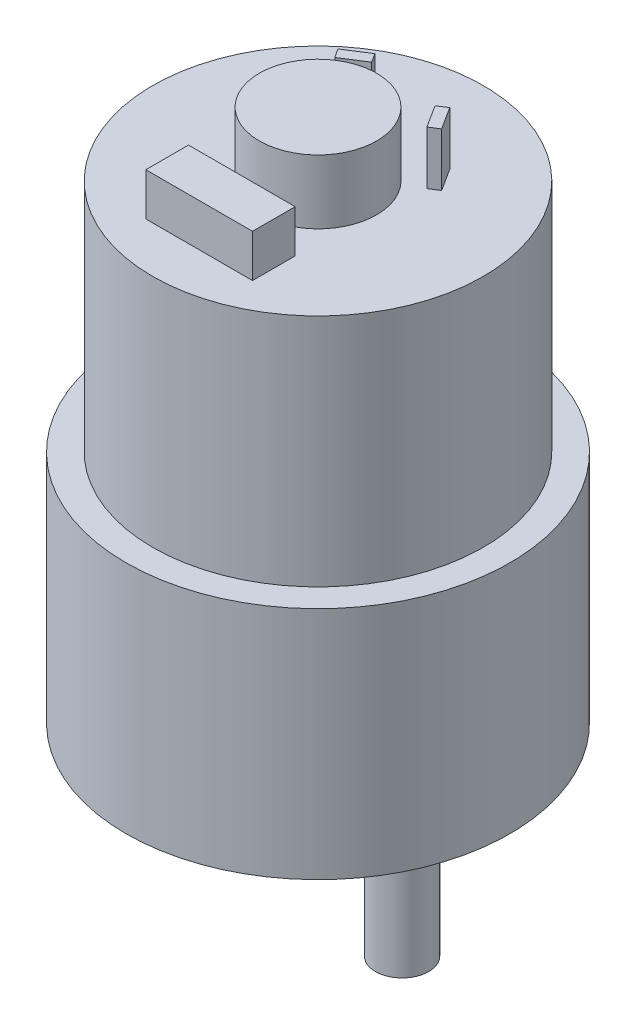
ISO-10303-21;
HEADER;
FILE_DESCRIPTION(('STEP AP214'),'2;1');
FILE_NAME('part.step','',(''),(''),'','','');
FILE_SCHEMA(('AUTOMOTIVE_DESIGN { 1 0 10303 214 1 1 1 1 }'));
ENDSEC;
DATA;
#1=APPLICATION_CONTEXT('core data for automotive mechanical design processes');
#2=APPLICATION_PROTOCOL_DEFINITION('international standard','automotive_design',2000,#1);
#3=PRODUCT_CONTEXT('',#1,'mechanical');
#4=PRODUCT('Part','Part','',(#3));
#5=PRODUCT_RELATED_PRODUCT_CATEGORY('part','',(#4));
#6=PRODUCT_DEFINITION_FORMATION('','',#4);
#7=PRODUCT_DEFINITION_CONTEXT('part definition',#1,'design');
#8=PRODUCT_DEFINITION('design','',#6,#7);
#9=PRODUCT_DEFINITION_SHAPE('','',#8);
#10=(LENGTH_UNIT() NAMED_UNIT(*) SI_UNIT(.MILLI.,.METRE.));
#11=(NAMED_UNIT(*) PLANE_ANGLE_UNIT() SI_UNIT($,.RADIAN.));
#12=(NAMED_UNIT(*) SI_UNIT($,.STERADIAN.) SOLID_ANGLE_UNIT());
#13=UNCERTAINTY_MEASURE_WITH_UNIT(LENGTH_MEASURE(1.E-05),#10,'distance_accuracy_value','');
#14=(GEOMETRIC_REPRESENTATION_CONTEXT(3) GLOBAL_UNCERTAINTY_ASSIGNED_CONTEXT((#13)) GLOBAL_UNIT_ASSIGNED_CONTEXT((#10,
#11,#12)) REPRESENTATION_CONTEXT('',''));
#15=CARTESIAN_POINT('',(0.,0.,0.));
#16=DIRECTION('',(0.,0.,1.));
#17=DIRECTION('',(1.,0.,0.));
#18=AXIS2_PLACEMENT_3D('',#15,#16,#17);
#19=CARTESIAN_POINT('',(0.,44.,0.));
#20=DIRECTION('',(0.,1.,0.));
#21=DIRECTION('',(0.,0.,1.));
#22=AXIS2_PLACEMENT_3D('',#19,#20,#21);
#23=PLANE('',#22);
#24=CARTESIAN_POINT('',(0.,44.,0.));
#25=DIRECTION('',(0.,1.,0.));
#26=DIRECTION('',(0.,0.,1.));
#27=AXIS2_PLACEMENT_3D('',#24,#25,#26);
#28=CIRCLE('',#27,5.5);
#29=CARTESIAN_POINT('',(0.,44.,5.5));
#30=VERTEX_POINT('',#29);
#31=EDGE_CURVE('E11',#30,#30,#28,.T.);
#32=ORIENTED_EDGE('',*,*,#31,.F.);
#33=EDGE_LOOP('',(#32));
#34=FACE_BOUND('',#33,.T.);
#35=CARTESIAN_POINT('',(0.,44.,0.));
#36=DIRECTION('',(0.,1.,0.));
#37=DIRECTION('',(0.,0.,1.));
#38=AXIS2_PLACEMENT_3D('',#35,#36,#37);
#39=CIRCLE('',#38,15.5);
#40=CARTESIAN_POINT('',(0.,44.,15.5));
#41=VERTEX_POINT('',#40);
#42=EDGE_CURVE('E230',#41,#41,#39,.T.);
#43=ORIENTED_EDGE('',*,*,#42,.T.);
#44=EDGE_LOOP('',(#43));
#45=FACE_BOUND('',#44,.T.);
#46=DIRECTION('',(0.538035452921857,0.,0.842922209577594));
#47=VECTOR('',#46,1.);
#48=CARTESIAN_POINT('',(-2.66640559773221,44.,-8.00192736355273));
#49=LINE('',#48,#47);
#50=CARTESIAN_POINT('',(-2.66640559773221,44.,-8.00192736355273));
#51=VERTEX_POINT('',#50);
#52=CARTESIAN_POINT('',(-2.12837014481036,44.,-7.15900515397514));
#53=VERTEX_POINT('',#52);
#54=EDGE_CURVE('E203',#51,#53,#49,.T.);
#55=ORIENTED_EDGE('',*,*,#54,.T.);
#56=DIRECTION('',(0.842922209577594,0.,-0.538035452921857));
#57=VECTOR('',#56,1.);
#58=CARTESIAN_POINT('',(-4.24050003100926,44.,-5.81083714150779));
#59=LINE('',#58,#57);
#60=CARTESIAN_POINT('',(-4.24050003100926,44.,-5.81083714150779));
#61=VERTEX_POINT('',#60);
#62=EDGE_CURVE('E187',#61,#53,#59,.T.);
#63=ORIENTED_EDGE('',*,*,#62,.F.);
#64=DIRECTION('',(-0.538035452921857,0.,-0.842922209577594));
#65=VECTOR('',#64,1.);
#66=CARTESIAN_POINT('',(-4.24050003100926,44.,-5.81083714150779));
#67=LINE('',#66,#65);
#68=CARTESIAN_POINT('',(-4.77853548393111,44.,-6.65375935108538));
#69=VERTEX_POINT('',#68);
#70=EDGE_CURVE('E191',#61,#69,#67,.T.);
#71=ORIENTED_EDGE('',*,*,#70,.T.);
#72=DIRECTION('',(0.842922209577594,0.,-0.538035452921857));
#73=VECTOR('',#72,1.);
#74=CARTESIAN_POINT('',(-4.77853548393111,44.,-6.65375935108538));
#75=LINE('',#74,#73);
#76=EDGE_CURVE('E205',#69,#51,#75,.T.);
#77=ORIENTED_EDGE('',*,*,#76,.T.);
#78=EDGE_LOOP('',(#55,#63,#71,#77));
#79=FACE_BOUND('',#78,.T.);
#80=DIRECTION('',(-0.842922209577593,0.,0.538035452921857));
#81=VECTOR('',#80,1.);
#82=CARTESIAN_POINT('',(6.56851747449733,44.,-5.02230351184538));
#83=LINE('',#82,#81);
#84=CARTESIAN_POINT('',(6.56851747449733,44.,-5.02230351184538));
#85=VERTEX_POINT('',#84);
#86=CARTESIAN_POINT('',(5.72559526491973,44.,-4.48426805892353));
#87=VERTEX_POINT('',#86);
#88=EDGE_CURVE('E62',#85,#87,#83,.T.);
#89=ORIENTED_EDGE('',*,*,#88,.T.);
#90=DIRECTION('',(0.538035452921857,0.,0.842922209577594));
#91=VECTOR('',#90,1.);
#92=CARTESIAN_POINT('',(4.38050663261509,44.,-6.59157358286751));
#93=LINE('',#92,#91);
#94=CARTESIAN_POINT('',(4.38050663261509,44.,-6.59157358286751));
#95=VERTEX_POINT('',#94);
#96=EDGE_CURVE('E153',#95,#87,#93,.T.);
#97=ORIENTED_EDGE('',*,*,#96,.F.);
#98=DIRECTION('',(0.842922209577594,0.,-0.538035452921857));
#99=VECTOR('',#98,1.);
#100=CARTESIAN_POINT('',(4.38050663261509,44.,-6.59157358286751));
#101=LINE('',#100,#99);
#102=CARTESIAN_POINT('',(5.22342884219268,44.,-7.12960903578937));
#103=VERTEX_POINT('',#102);
#104=EDGE_CURVE('E163',#95,#103,#101,.T.);
#105=ORIENTED_EDGE('',*,*,#104,.T.);
#106=DIRECTION('',(0.538035452921857,0.,0.842922209577594));
#107=VECTOR('',#106,1.);
#108=CARTESIAN_POINT('',(5.22342884219268,44.,-7.12960903578937));
#109=LINE('',#108,#107);
#110=EDGE_CURVE('E174',#103,#85,#109,.T.);
#111=ORIENTED_EDGE('',*,*,#110,.T.);
#112=EDGE_LOOP('',(#89,#97,#105,#111));
#113=FACE_BOUND('',#112,.T.);
#114=DIRECTION('',(1.,0.,0.));
#115=VECTOR('',#114,1.);
#116=CARTESIAN_POINT('',(-4.98556050699772,44.,11.1552508729265));
#117=LINE('',#116,#115);
#118=CARTESIAN_POINT('',(-4.98556050699772,44.,11.1552508729265));
#119=VERTEX_POINT('',#118);
#120=CARTESIAN_POINT('',(5.01443949300228,44.,11.1552508729265));
#121=VERTEX_POINT('',#120);
#122=EDGE_CURVE('E502',#119,#121,#117,.T.);
#123=ORIENTED_EDGE('',*,*,#122,.F.);
#124=DIRECTION('',(0.,0.,1.));
#125=VECTOR('',#124,1.);
#126=CARTESIAN_POINT('',(-4.98556050699772,44.,7.15525087292646));
#127=LINE('',#126,#125);
#128=CARTESIAN_POINT('',(-4.98556050699772,44.,7.15525087292646));
#129=VERTEX_POINT('',#128);
#130=EDGE_CURVE('E151',#129,#119,#127,.T.);
#131=ORIENTED_EDGE('',*,*,#130,.F.);
#132=DIRECTION('',(-1.,0.,0.));
#133=VECTOR('',#132,1.);
#134=CARTESIAN_POINT('',(-4.98556050699772,44.,7.15525087292646));
#135=LINE('',#134,#133);
#136=CARTESIAN_POINT('',(5.01443949300228,44.,7.15525087292646));
#137=VERTEX_POINT('',#136);
#138=EDGE_CURVE('E147',#137,#129,#135,.T.);
#139=ORIENTED_EDGE('',*,*,#138,.F.);
#140=DIRECTION('',(0.,0.,-1.));
#141=VECTOR('',#140,1.);
#142=CARTESIAN_POINT('',(5.01443949300228,44.,7.15525087292646));
#143=LINE('',#142,#141);
#144=EDGE_CURVE('E499',#121,#137,#143,.T.);
#145=ORIENTED_EDGE('',*,*,#144,.F.);
#146=EDGE_LOOP('',(#123,#131,#139,#145));
#147=FACE_BOUND('',#146,.T.);
#148=ADVANCED_FACE('F37',(#34,#45,#79,#113,#147),#23,.T.);
#149=CARTESIAN_POINT('',(0.,22.,0.));
#150=DIRECTION('',(0.,-1.,0.));
#151=DIRECTION('',(0.,0.,-1.));
#152=AXIS2_PLACEMENT_3D('',#149,#150,#151);
#153=CYLINDRICAL_SURFACE('',#152,18.);
#154=CARTESIAN_POINT('',(0.,22.,0.));
#155=DIRECTION('',(0.,1.,0.));
#156=DIRECTION('',(0.,0.,1.));
#157=AXIS2_PLACEMENT_3D('',#154,#155,#156);
#158=CIRCLE('',#157,18.);
#159=CARTESIAN_POINT('',(0.,22.,18.));
#160=VERTEX_POINT('',#159);
#161=EDGE_CURVE('E237',#160,#160,#158,.T.);
#162=ORIENTED_EDGE('',*,*,#161,.F.);
#163=EDGE_LOOP('',(#162));
#164=FACE_BOUND('',#163,.T.);
#165=CARTESIAN_POINT('',(0.,0.,0.));
#166=DIRECTION('',(0.,1.,0.));
#167=DIRECTION('',(0.,0.,1.));
#168=AXIS2_PLACEMENT_3D('',#165,#166,#167);
#169=CIRCLE('',#168,18.);
#170=CARTESIAN_POINT('',(0.,0.,18.));
#171=VERTEX_POINT('',#170);
#172=EDGE_CURVE('E233',#171,#171,#169,.T.);
#173=ORIENTED_EDGE('',*,*,#172,.T.);
#174=EDGE_LOOP('',(#173));
#175=FACE_BOUND('',#174,.T.);
#176=ADVANCED_FACE('F39',(#164,#175),#153,.T.);
#177=CARTESIAN_POINT('',(0.,22.,0.));
#178=DIRECTION('',(0.,1.,0.));
#179=DIRECTION('',(0.,0.,1.));
#180=AXIS2_PLACEMENT_3D('',#177,#178,#179);
#181=PLANE('',#180);
#182=CARTESIAN_POINT('',(0.,22.,0.));
#183=DIRECTION('',(0.,1.,0.));
#184=DIRECTION('',(0.,0.,1.));
#185=AXIS2_PLACEMENT_3D('',#182,#183,#184);
#186=CIRCLE('',#185,15.5);
#187=CARTESIAN_POINT('',(0.,22.,15.5));
#188=VERTEX_POINT('',#187);
#189=EDGE_CURVE('E234',#188,#188,#186,.T.);
#190=ORIENTED_EDGE('',*,*,#189,.F.);
#191=EDGE_LOOP('',(#190));
#192=FACE_BOUND('',#191,.T.);
#193=ORIENTED_EDGE('',*,*,#161,.T.);
#194=EDGE_LOOP('',(#193));
#195=FACE_BOUND('',#194,.T.);
#196=ADVANCED_FACE('F246',(#192,#195),#181,.T.);
#197=CARTESIAN_POINT('',(0.,0.,0.));
#198=DIRECTION('',(0.,1.,0.));
#199=DIRECTION('',(0.,0.,1.));
#200=AXIS2_PLACEMENT_3D('',#197,#198,#199);
#201=PLANE('',#200);
#202=CARTESIAN_POINT('',(7.98747404895295,0.,0.));
#203=DIRECTION('',(0.,1.,0.));
#204=DIRECTION('',(0.,0.,1.));
#205=AXIS2_PLACEMENT_3D('',#202,#203,#204);
#206=CIRCLE('',#205,5.);
#207=CARTESIAN_POINT('',(7.98747404895295,0.,5.));
#208=VERTEX_POINT('',#207);
#209=EDGE_CURVE('E41',#208,#208,#206,.F.);
#210=ORIENTED_EDGE('',*,*,#209,.F.);
#211=EDGE_LOOP('',(#210));
#212=FACE_BOUND('',#211,.T.);
#213=ORIENTED_EDGE('',*,*,#172,.F.);
#214=EDGE_LOOP('',(#213));
#215=FACE_BOUND('',#214,.T.);
#216=ADVANCED_FACE('F243',(#212,#215),#201,.F.);
#217=CARTESIAN_POINT('',(0.,44.,0.));
#218=DIRECTION('',(0.,-1.,0.));
#219=DIRECTION('',(0.,0.,-1.));
#220=AXIS2_PLACEMENT_3D('',#217,#218,#219);
#221=CYLINDRICAL_SURFACE('',#220,15.5);
#222=ORIENTED_EDGE('',*,*,#42,.F.);
#223=EDGE_LOOP('',(#222));
#224=FACE_BOUND('',#223,.T.);
#225=ORIENTED_EDGE('',*,*,#189,.T.);
#226=EDGE_LOOP('',(#225));
#227=FACE_BOUND('',#226,.T.);
#228=ADVANCED_FACE('F245',(#224,#227),#221,.T.);
#229=CARTESIAN_POINT('',(7.98747404895295,-3.,0.));
#230=DIRECTION('',(0.,1.,0.));
#231=DIRECTION('',(0.,0.,1.));
#232=AXIS2_PLACEMENT_3D('',#229,#230,#231);
#233=CYLINDRICAL_SURFACE('',#232,5.);
#234=CARTESIAN_POINT('',(7.98747404895295,-3.,0.));
#235=DIRECTION('',(0.,-1.,0.));
#236=DIRECTION('',(0.,0.,-1.));
#237=AXIS2_PLACEMENT_3D('',#234,#235,#236);
#238=CIRCLE('',#237,5.);
#239=CARTESIAN_POINT('',(7.98747404895295,-3.,-5.));
#240=VERTEX_POINT('',#239);
#241=EDGE_CURVE('E225',#240,#240,#238,.T.);
#242=ORIENTED_EDGE('',*,*,#241,.F.);
#243=EDGE_LOOP('',(#242));
#244=FACE_BOUND('',#243,.T.);
#245=ORIENTED_EDGE('',*,*,#209,.T.);
#246=EDGE_LOOP('',(#245));
#247=FACE_BOUND('',#246,.T.);
#248=ADVANCED_FACE('F252',(#244,#247),#233,.T.);
#249=CARTESIAN_POINT('',(7.98747404895295,-3.,0.));
#250=DIRECTION('',(0.,-1.,0.));
#251=DIRECTION('',(0.,0.,-1.));
#252=AXIS2_PLACEMENT_3D('',#249,#250,#251);
#253=PLANE('',#252);
#254=CARTESIAN_POINT('',(7.88470234107308,-3.,0.));
#255=DIRECTION('',(0.,-1.,0.));
#256=DIRECTION('',(0.,0.,-1.));
#257=AXIS2_PLACEMENT_3D('',#254,#255,#256);
#258=CIRCLE('',#257,2.5);
#259=CARTESIAN_POINT('',(7.88470234107308,-3.,-2.5));
#260=VERTEX_POINT('',#259);
#261=EDGE_CURVE('E46',#260,#260,#258,.T.);
#262=ORIENTED_EDGE('',*,*,#261,.F.);
#263=EDGE_LOOP('',(#262));
#264=FACE_BOUND('',#263,.T.);
#265=ORIENTED_EDGE('',*,*,#241,.T.);
#266=EDGE_LOOP('',(#265));
#267=FACE_BOUND('',#266,.T.);
#268=ADVANCED_FACE('F270',(#264,#267),#253,.T.);
#269=CARTESIAN_POINT('',(7.88470234107308,-15.,0.));
#270=DIRECTION('',(0.,1.,0.));
#271=DIRECTION('',(0.,0.,1.));
#272=AXIS2_PLACEMENT_3D('',#269,#270,#271);
#273=CYLINDRICAL_SURFACE('',#272,2.5);
#274=CARTESIAN_POINT('',(7.88470234107308,-15.,0.));
#275=DIRECTION('',(0.,-1.,0.));
#276=DIRECTION('',(0.,0.,-1.));
#277=AXIS2_PLACEMENT_3D('',#274,#275,#276);
#278=CIRCLE('',#277,2.5);
#279=CARTESIAN_POINT('',(7.88470234107308,-15.,-2.5));
#280=VERTEX_POINT('',#279);
#281=EDGE_CURVE('E221',#280,#280,#278,.T.);
#282=ORIENTED_EDGE('',*,*,#281,.F.);
#283=EDGE_LOOP('',(#282));
#284=FACE_BOUND('',#283,.T.);
#285=ORIENTED_EDGE('',*,*,#261,.T.);
#286=EDGE_LOOP('',(#285));
#287=FACE_BOUND('',#286,.T.);
#288=ADVANCED_FACE('F274',(#284,#287),#273,.T.);
#289=CARTESIAN_POINT('',(7.88470234107308,-15.,0.));
#290=DIRECTION('',(0.,-1.,0.));
#291=DIRECTION('',(0.,0.,-1.));
#292=AXIS2_PLACEMENT_3D('',#289,#290,#291);
#293=PLANE('',#292);
#294=ORIENTED_EDGE('',*,*,#281,.T.);
#295=EDGE_LOOP('',(#294));
#296=FACE_BOUND('',#295,.T.);
#297=ADVANCED_FACE('F278',(#296),#293,.T.);
#298=CARTESIAN_POINT('',(0.,50.,0.));
#299=DIRECTION('',(0.,-1.,0.));
#300=DIRECTION('',(0.,0.,-1.));
#301=AXIS2_PLACEMENT_3D('',#298,#299,#300);
#302=CYLINDRICAL_SURFACE('',#301,5.5);
#303=CARTESIAN_POINT('',(0.,50.,0.));
#304=DIRECTION('',(0.,1.,0.));
#305=DIRECTION('',(0.,0.,1.));
#306=AXIS2_PLACEMENT_3D('',#303,#304,#305);
#307=CIRCLE('',#306,5.5);
#308=CARTESIAN_POINT('',(0.,50.,5.5));
#309=VERTEX_POINT('',#308);
#310=EDGE_CURVE('E219',#309,#309,#307,.T.);
#311=ORIENTED_EDGE('',*,*,#310,.F.);
#312=EDGE_LOOP('',(#311));
#313=FACE_BOUND('',#312,.T.);
#314=ORIENTED_EDGE('',*,*,#31,.T.);
#315=EDGE_LOOP('',(#314));
#316=FACE_BOUND('',#315,.T.);
#317=ADVANCED_FACE('F282',(#313,#316),#302,.T.);
#318=CARTESIAN_POINT('',(0.,50.,0.));
#319=DIRECTION('',(0.,1.,0.));
#320=DIRECTION('',(0.,0.,1.));
#321=AXIS2_PLACEMENT_3D('',#318,#319,#320);
#322=PLANE('',#321);
#323=ORIENTED_EDGE('',*,*,#310,.T.);
#324=EDGE_LOOP('',(#323));
#325=FACE_BOUND('',#324,.T.);
#326=ADVANCED_FACE('F286',(#325),#322,.T.);
#327=CARTESIAN_POINT('',(-4.24050003100926,49.0038842658235,-5.81083714150779));
#328=DIRECTION('',(-0.538035452921857,0.,-0.842922209577594));
#329=DIRECTION('',(-0.842922209577594,0.,0.538035452921857));
#330=AXIS2_PLACEMENT_3D('',#327,#328,#329);
#331=PLANE('',#330);
#332=ORIENTED_EDGE('',*,*,#62,.T.);
#333=DIRECTION('',(0.,-1.,0.));
#334=VECTOR('',#333,1.);
#335=CARTESIAN_POINT('',(-2.12837014481036,49.0038842658235,-7.15900515397514));
#336=LINE('',#335,#334);
#337=CARTESIAN_POINT('',(-2.12837014481036,49.0038842658235,-7.15900515397514));
#338=VERTEX_POINT('',#337);
#339=EDGE_CURVE('E216',#338,#53,#336,.T.);
#340=ORIENTED_EDGE('',*,*,#339,.F.);
#341=DIRECTION('',(0.842922209577594,0.,-0.538035452921857));
#342=VECTOR('',#341,1.);
#343=CARTESIAN_POINT('',(-4.24050003100926,49.0038842658235,-5.81083714150779));
#344=LINE('',#343,#342);
#345=CARTESIAN_POINT('',(-4.24050003100926,49.0038842658235,-5.81083714150779));
#346=VERTEX_POINT('',#345);
#347=EDGE_CURVE('E188',#346,#338,#344,.T.);
#348=ORIENTED_EDGE('',*,*,#347,.F.);
#349=DIRECTION('',(0.,-1.,0.));
#350=VECTOR('',#349,1.);
#351=CARTESIAN_POINT('',(-4.24050003100926,49.0038842658235,-5.81083714150779));
#352=LINE('',#351,#350);
#353=EDGE_CURVE('E200',#346,#61,#352,.T.);
#354=ORIENTED_EDGE('',*,*,#353,.T.);
#355=EDGE_LOOP('',(#332,#340,#348,#354));
#356=FACE_BOUND('',#355,.T.);
#357=ADVANCED_FACE('F290',(#356),#331,.F.);
#358=CARTESIAN_POINT('',(-2.66640559773221,49.0038842658235,-8.00192736355273));
#359=DIRECTION('',(0.842922209577593,0.,-0.538035452921857));
#360=DIRECTION('',(-0.538035452921857,0.,-0.842922209577593));
#361=AXIS2_PLACEMENT_3D('',#358,#359,#360);
#362=PLANE('',#361);
#363=ORIENTED_EDGE('',*,*,#54,.F.);
#364=DIRECTION('',(0.,-1.,0.));
#365=VECTOR('',#364,1.);
#366=CARTESIAN_POINT('',(-2.66640559773221,49.0038842658235,-8.00192736355273));
#367=LINE('',#366,#365);
#368=CARTESIAN_POINT('',(-2.66640559773221,49.0038842658235,-8.00192736355273));
#369=VERTEX_POINT('',#368);
#370=EDGE_CURVE('E213',#369,#51,#367,.T.);
#371=ORIENTED_EDGE('',*,*,#370,.F.);
#372=DIRECTION('',(0.538035452921857,0.,0.842922209577594));
#373=VECTOR('',#372,1.);
#374=CARTESIAN_POINT('',(-2.66640559773221,49.0038842658235,-8.00192736355273));
#375=LINE('',#374,#373);
#376=EDGE_CURVE('E190',#369,#338,#375,.T.);
#377=ORIENTED_EDGE('',*,*,#376,.T.);
#378=ORIENTED_EDGE('',*,*,#339,.T.);
#379=EDGE_LOOP('',(#363,#371,#377,#378));
#380=FACE_BOUND('',#379,.T.);
#381=ADVANCED_FACE('F294',(#380),#362,.T.);
#382=CARTESIAN_POINT('',(-4.77853548393111,49.0038842658235,-6.65375935108538));
#383=DIRECTION('',(-0.538035452921857,0.,-0.842922209577594));
#384=DIRECTION('',(-0.842922209577594,0.,0.538035452921857));
#385=AXIS2_PLACEMENT_3D('',#382,#383,#384);
#386=PLANE('',#385);
#387=ORIENTED_EDGE('',*,*,#76,.F.);
#388=DIRECTION('',(0.,-1.,0.));
#389=VECTOR('',#388,1.);
#390=CARTESIAN_POINT('',(-4.77853548393111,49.0038842658235,-6.65375935108538));
#391=LINE('',#390,#389);
#392=CARTESIAN_POINT('',(-4.77853548393111,49.0038842658235,-6.65375935108538));
#393=VERTEX_POINT('',#392);
#394=EDGE_CURVE('E210',#393,#69,#391,.T.);
#395=ORIENTED_EDGE('',*,*,#394,.F.);
#396=DIRECTION('',(0.842922209577594,0.,-0.538035452921857));
#397=VECTOR('',#396,1.);
#398=CARTESIAN_POINT('',(-4.77853548393111,49.0038842658235,-6.65375935108538));
#399=LINE('',#398,#397);
#400=EDGE_CURVE('E194',#393,#369,#399,.T.);
#401=ORIENTED_EDGE('',*,*,#400,.T.);
#402=ORIENTED_EDGE('',*,*,#370,.T.);
#403=EDGE_LOOP('',(#387,#395,#401,#402));
#404=FACE_BOUND('',#403,.T.);
#405=ADVANCED_FACE('F298',(#404),#386,.T.);
#406=CARTESIAN_POINT('',(-4.24050003100926,49.0038842658235,-5.81083714150779));
#407=DIRECTION('',(-0.842922209577594,0.,0.538035452921857));
#408=DIRECTION('',(0.538035452921857,0.,0.842922209577594));
#409=AXIS2_PLACEMENT_3D('',#406,#407,#408);
#410=PLANE('',#409);
#411=ORIENTED_EDGE('',*,*,#70,.F.);
#412=ORIENTED_EDGE('',*,*,#353,.F.);
#413=DIRECTION('',(-0.538035452921857,0.,-0.842922209577594));
#414=VECTOR('',#413,1.);
#415=CARTESIAN_POINT('',(-4.24050003100926,49.0038842658235,-5.81083714150779));
#416=LINE('',#415,#414);
#417=EDGE_CURVE('E197',#346,#393,#416,.T.);
#418=ORIENTED_EDGE('',*,*,#417,.T.);
#419=ORIENTED_EDGE('',*,*,#394,.T.);
#420=EDGE_LOOP('',(#411,#412,#418,#419));
#421=FACE_BOUND('',#420,.T.);
#422=ADVANCED_FACE('F302',(#421),#410,.T.);
#423=CARTESIAN_POINT('',(0.,49.0038842658235,0.));
#424=DIRECTION('',(0.,-1.,0.));
#425=DIRECTION('',(-1.,0.,0.));
#426=AXIS2_PLACEMENT_3D('',#423,#424,#425);
#427=PLANE('',#426);
#428=ORIENTED_EDGE('',*,*,#347,.T.);
#429=ORIENTED_EDGE('',*,*,#376,.F.);
#430=ORIENTED_EDGE('',*,*,#400,.F.);
#431=ORIENTED_EDGE('',*,*,#417,.F.);
#432=EDGE_LOOP('',(#428,#429,#430,#431));
#433=FACE_BOUND('',#432,.T.);
#434=ADVANCED_FACE('F306',(#433),#427,.F.);
#435=CARTESIAN_POINT('',(4.38050663261509,49.0038842658235,-6.59157358286751));
#436=DIRECTION('',(0.842922209577594,0.,-0.538035452921857));
#437=DIRECTION('',(-0.538035452921857,0.,-0.842922209577594));
#438=AXIS2_PLACEMENT_3D('',#435,#436,#437);
#439=PLANE('',#438);
#440=ORIENTED_EDGE('',*,*,#96,.T.);
#441=DIRECTION('',(0.,-1.,0.));
#442=VECTOR('',#441,1.);
#443=CARTESIAN_POINT('',(5.72559526491973,49.0038842658235,-4.48426805892353));
#444=LINE('',#443,#442);
#445=CARTESIAN_POINT('',(5.72559526491973,49.0038842658235,-4.48426805892353));
#446=VERTEX_POINT('',#445);
#447=EDGE_CURVE('E185',#446,#87,#444,.T.);
#448=ORIENTED_EDGE('',*,*,#447,.F.);
#449=DIRECTION('',(0.538035452921857,0.,0.842922209577594));
#450=VECTOR('',#449,1.);
#451=CARTESIAN_POINT('',(4.38050663261509,49.0038842658235,-6.59157358286751));
#452=LINE('',#451,#450);
#453=CARTESIAN_POINT('',(4.38050663261509,49.0038842658235,-6.59157358286751));
#454=VERTEX_POINT('',#453);
#455=EDGE_CURVE('E160',#454,#446,#452,.T.);
#456=ORIENTED_EDGE('',*,*,#455,.F.);
#457=DIRECTION('',(0.,-1.,0.));
#458=VECTOR('',#457,1.);
#459=CARTESIAN_POINT('',(4.38050663261509,49.0038842658235,-6.59157358286751));
#460=LINE('',#459,#458);
#461=EDGE_CURVE('E171',#454,#95,#460,.T.);
#462=ORIENTED_EDGE('',*,*,#461,.T.);
#463=EDGE_LOOP('',(#440,#448,#456,#462));
#464=FACE_BOUND('',#463,.T.);
#465=ADVANCED_FACE('F310',(#464),#439,.F.);
#466=CARTESIAN_POINT('',(6.56851747449733,49.0038842658235,-5.02230351184538));
#467=DIRECTION('',(0.538035452921857,0.,0.842922209577593));
#468=DIRECTION('',(0.842922209577593,0.,-0.538035452921857));
#469=AXIS2_PLACEMENT_3D('',#466,#467,#468);
#470=PLANE('',#469);
#471=ORIENTED_EDGE('',*,*,#88,.F.);
#472=DIRECTION('',(0.,-1.,0.));
#473=VECTOR('',#472,1.);
#474=CARTESIAN_POINT('',(6.56851747449733,49.0038842658235,-5.02230351184538));
#475=LINE('',#474,#473);
#476=CARTESIAN_POINT('',(6.56851747449733,49.0038842658235,-5.02230351184538));
#477=VERTEX_POINT('',#476);
#478=EDGE_CURVE('E182',#477,#85,#475,.T.);
#479=ORIENTED_EDGE('',*,*,#478,.F.);
#480=DIRECTION('',(-0.842922209577593,0.,0.538035452921857));
#481=VECTOR('',#480,1.);
#482=CARTESIAN_POINT('',(6.56851747449733,49.0038842658235,-5.02230351184538));
#483=LINE('',#482,#481);
#484=EDGE_CURVE('E162',#477,#446,#483,.T.);
#485=ORIENTED_EDGE('',*,*,#484,.T.);
#486=ORIENTED_EDGE('',*,*,#447,.T.);
#487=EDGE_LOOP('',(#471,#479,#485,#486));
#488=FACE_BOUND('',#487,.T.);
#489=ADVANCED_FACE('F314',(#488),#470,.T.);
#490=CARTESIAN_POINT('',(5.22342884219268,49.0038842658235,-7.12960903578937));
#491=DIRECTION('',(0.842922209577594,0.,-0.538035452921857));
#492=DIRECTION('',(-0.538035452921857,0.,-0.842922209577594));
#493=AXIS2_PLACEMENT_3D('',#490,#491,#492);
#494=PLANE('',#493);
#495=ORIENTED_EDGE('',*,*,#110,.F.);
#496=DIRECTION('',(0.,-1.,0.));
#497=VECTOR('',#496,1.);
#498=CARTESIAN_POINT('',(5.22342884219268,49.0038842658235,-7.12960903578937));
#499=LINE('',#498,#497);
#500=CARTESIAN_POINT('',(5.22342884219268,49.0038842658235,-7.12960903578937));
#501=VERTEX_POINT('',#500);
#502=EDGE_CURVE('E179',#501,#103,#499,.T.);
#503=ORIENTED_EDGE('',*,*,#502,.F.);
#504=DIRECTION('',(0.538035452921857,0.,0.842922209577594));
#505=VECTOR('',#504,1.);
#506=CARTESIAN_POINT('',(5.22342884219268,49.0038842658235,-7.12960903578937));
#507=LINE('',#506,#505);
#508=EDGE_CURVE('E166',#501,#477,#507,.T.);
#509=ORIENTED_EDGE('',*,*,#508,.T.);
#510=ORIENTED_EDGE('',*,*,#478,.T.);
#511=EDGE_LOOP('',(#495,#503,#509,#510));
#512=FACE_BOUND('',#511,.T.);
#513=ADVANCED_FACE('F318',(#512),#494,.T.);
#514=CARTESIAN_POINT('',(4.38050663261509,49.0038842658235,-6.59157358286751));
#515=DIRECTION('',(-0.538035452921857,0.,-0.842922209577594));
#516=DIRECTION('',(-0.842922209577594,0.,0.538035452921857));
#517=AXIS2_PLACEMENT_3D('',#514,#515,#516);
#518=PLANE('',#517);
#519=ORIENTED_EDGE('',*,*,#104,.F.);
#520=ORIENTED_EDGE('',*,*,#461,.F.);
#521=DIRECTION('',(0.842922209577594,0.,-0.538035452921857));
#522=VECTOR('',#521,1.);
#523=CARTESIAN_POINT('',(4.38050663261509,49.0038842658235,-6.59157358286751));
#524=LINE('',#523,#522);
#525=EDGE_CURVE('E169',#454,#501,#524,.T.);
#526=ORIENTED_EDGE('',*,*,#525,.T.);
#527=ORIENTED_EDGE('',*,*,#502,.T.);
#528=EDGE_LOOP('',(#519,#520,#526,#527));
#529=FACE_BOUND('',#528,.T.);
#530=ADVANCED_FACE('F322',(#529),#518,.T.);
#531=CARTESIAN_POINT('',(0.,49.0038842658235,0.));
#532=DIRECTION('',(0.,-1.,0.));
#533=DIRECTION('',(-1.,0.,0.));
#534=AXIS2_PLACEMENT_3D('',#531,#532,#533);
#535=PLANE('',#534);
#536=ORIENTED_EDGE('',*,*,#455,.T.);
#537=ORIENTED_EDGE('',*,*,#484,.F.);
#538=ORIENTED_EDGE('',*,*,#508,.F.);
#539=ORIENTED_EDGE('',*,*,#525,.F.);
#540=EDGE_LOOP('',(#536,#537,#538,#539));
#541=FACE_BOUND('',#540,.T.);
#542=ADVANCED_FACE('F326',(#541),#535,.F.);
#543=CARTESIAN_POINT('',(-4.98556050699772,48.,7.15525087292646));
#544=DIRECTION('',(1.,0.,0.));
#545=DIRECTION('',(0.,0.,-1.));
#546=AXIS2_PLACEMENT_3D('',#543,#544,#545);
#547=PLANE('',#546);
#548=ORIENTED_EDGE('',*,*,#130,.T.);
#549=DIRECTION('',(0.,-1.,0.));
#550=VECTOR('',#549,1.);
#551=CARTESIAN_POINT('',(-4.98556050699772,48.,11.1552508729265));
#552=LINE('',#551,#550);
#553=CARTESIAN_POINT('',(-4.98556050699772,48.,11.1552508729265));
#554=VERTEX_POINT('',#553);
#555=EDGE_CURVE('E132',#554,#119,#552,.T.);
#556=ORIENTED_EDGE('',*,*,#555,.F.);
#557=DIRECTION('',(0.,0.,1.));
#558=VECTOR('',#557,1.);
#559=CARTESIAN_POINT('',(-4.98556050699772,48.,7.15525087292646));
#560=LINE('',#559,#558);
#561=CARTESIAN_POINT('',(-4.98556050699772,48.,7.15525087292646));
#562=VERTEX_POINT('',#561);
#563=EDGE_CURVE('E139',#562,#554,#560,.T.);
#564=ORIENTED_EDGE('',*,*,#563,.F.);
#565=DIRECTION('',(0.,-1.,0.));
#566=VECTOR('',#565,1.);
#567=CARTESIAN_POINT('',(-4.98556050699772,48.,7.15525087292646));
#568=LINE('',#567,#566);
#569=EDGE_CURVE('E496',#562,#129,#568,.T.);
#570=ORIENTED_EDGE('',*,*,#569,.T.);
#571=EDGE_LOOP('',(#548,#556,#564,#570));
#572=FACE_BOUND('',#571,.T.);
#573=ADVANCED_FACE('F149',(#572),#547,.F.);
#574=CARTESIAN_POINT('',(-4.98556050699772,48.,11.1552508729265));
#575=DIRECTION('',(0.,0.,-1.));
#576=DIRECTION('',(-1.,0.,0.));
#577=AXIS2_PLACEMENT_3D('',#574,#575,#576);
#578=PLANE('',#577);
#579=ORIENTED_EDGE('',*,*,#122,.T.);
#580=DIRECTION('',(0.,-1.,0.));
#581=VECTOR('',#580,1.);
#582=CARTESIAN_POINT('',(5.01443949300228,48.,11.1552508729265));
#583=LINE('',#582,#581);
#584=CARTESIAN_POINT('',(5.01443949300228,48.,11.1552508729265));
#585=VERTEX_POINT('',#584);
#586=EDGE_CURVE('E135',#585,#121,#583,.T.);
#587=ORIENTED_EDGE('',*,*,#586,.F.);
#588=DIRECTION('',(1.,0.,0.));
#589=VECTOR('',#588,1.);
#590=CARTESIAN_POINT('',(-4.98556050699772,48.,11.1552508729265));
#591=LINE('',#590,#589);
#592=EDGE_CURVE('E128',#554,#585,#591,.T.);
#593=ORIENTED_EDGE('',*,*,#592,.F.);
#594=ORIENTED_EDGE('',*,*,#555,.T.);
#595=EDGE_LOOP('',(#579,#587,#593,#594));
#596=FACE_BOUND('',#595,.T.);
#597=ADVANCED_FACE('F130',(#596),#578,.F.);
#598=CARTESIAN_POINT('',(5.01443949300228,48.,7.15525087292646));
#599=DIRECTION('',(-1.,0.,0.));
#600=DIRECTION('',(0.,0.,1.));
#601=AXIS2_PLACEMENT_3D('',#598,#599,#600);
#602=PLANE('',#601);
#603=ORIENTED_EDGE('',*,*,#144,.T.);
#604=DIRECTION('',(0.,-1.,0.));
#605=VECTOR('',#604,1.);
#606=CARTESIAN_POINT('',(5.01443949300228,48.,7.15525087292646));
#607=LINE('',#606,#605);
#608=CARTESIAN_POINT('',(5.01443949300228,48.,7.15525087292646));
#609=VERTEX_POINT('',#608);
#610=EDGE_CURVE('E54',#609,#137,#607,.T.);
#611=ORIENTED_EDGE('',*,*,#610,.F.);
#612=DIRECTION('',(0.,0.,-1.));
#613=VECTOR('',#612,1.);
#614=CARTESIAN_POINT('',(5.01443949300228,48.,7.15525087292646));
#615=LINE('',#614,#613);
#616=EDGE_CURVE('E138',#585,#609,#615,.T.);
#617=ORIENTED_EDGE('',*,*,#616,.F.);
#618=ORIENTED_EDGE('',*,*,#586,.T.);
#619=EDGE_LOOP('',(#603,#611,#617,#618));
#620=FACE_BOUND('',#619,.T.);
#621=ADVANCED_FACE('F335',(#620),#602,.F.);
#622=CARTESIAN_POINT('',(-4.98556050699772,48.,7.15525087292646));
#623=DIRECTION('',(0.,0.,1.));
#624=DIRECTION('',(1.,0.,0.));
#625=AXIS2_PLACEMENT_3D('',#622,#623,#624);
#626=PLANE('',#625);
#627=ORIENTED_EDGE('',*,*,#138,.T.);
#628=ORIENTED_EDGE('',*,*,#569,.F.);
#629=DIRECTION('',(-1.,0.,0.));
#630=VECTOR('',#629,1.);
#631=CARTESIAN_POINT('',(-4.98556050699772,48.,7.15525087292646));
#632=LINE('',#631,#630);
#633=EDGE_CURVE('E143',#609,#562,#632,.T.);
#634=ORIENTED_EDGE('',*,*,#633,.F.);
#635=ORIENTED_EDGE('',*,*,#610,.T.);
#636=EDGE_LOOP('',(#627,#628,#634,#635));
#637=FACE_BOUND('',#636,.T.);
#638=ADVANCED_FACE('F338',(#637),#626,.F.);
#639=CARTESIAN_POINT('',(0.,48.,0.));
#640=DIRECTION('',(0.,1.,0.));
#641=DIRECTION('',(0.,0.,1.));
#642=AXIS2_PLACEMENT_3D('',#639,#640,#641);
#643=PLANE('',#642);
#644=ORIENTED_EDGE('',*,*,#563,.T.);
#645=ORIENTED_EDGE('',*,*,#592,.T.);
#646=ORIENTED_EDGE('',*,*,#616,.T.);
#647=ORIENTED_EDGE('',*,*,#633,.T.);
#648=EDGE_LOOP('',(#644,#645,#646,#647));
#649=FACE_BOUND('',#648,.T.);
#650=ADVANCED_FACE('F142',(#649),#643,.T.);
#651=CLOSED_SHELL('',(#148,#176,#196,#216,#228,#248,#268,#288,#297,#317,#326,#357,#381,#405,
#422,#434,#465,#489,#513,#530,#542,#573,#597,#621,#638,#650));
#652=MANIFOLD_SOLID_BREP('B2',#651);
#653=ADVANCED_BREP_SHAPE_REPRESENTATION('',(#18,#652),#14);
#654=SHAPE_DEFINITION_REPRESENTATION(#9,#653);
ENDSEC;
END-ISO-10303-21;
